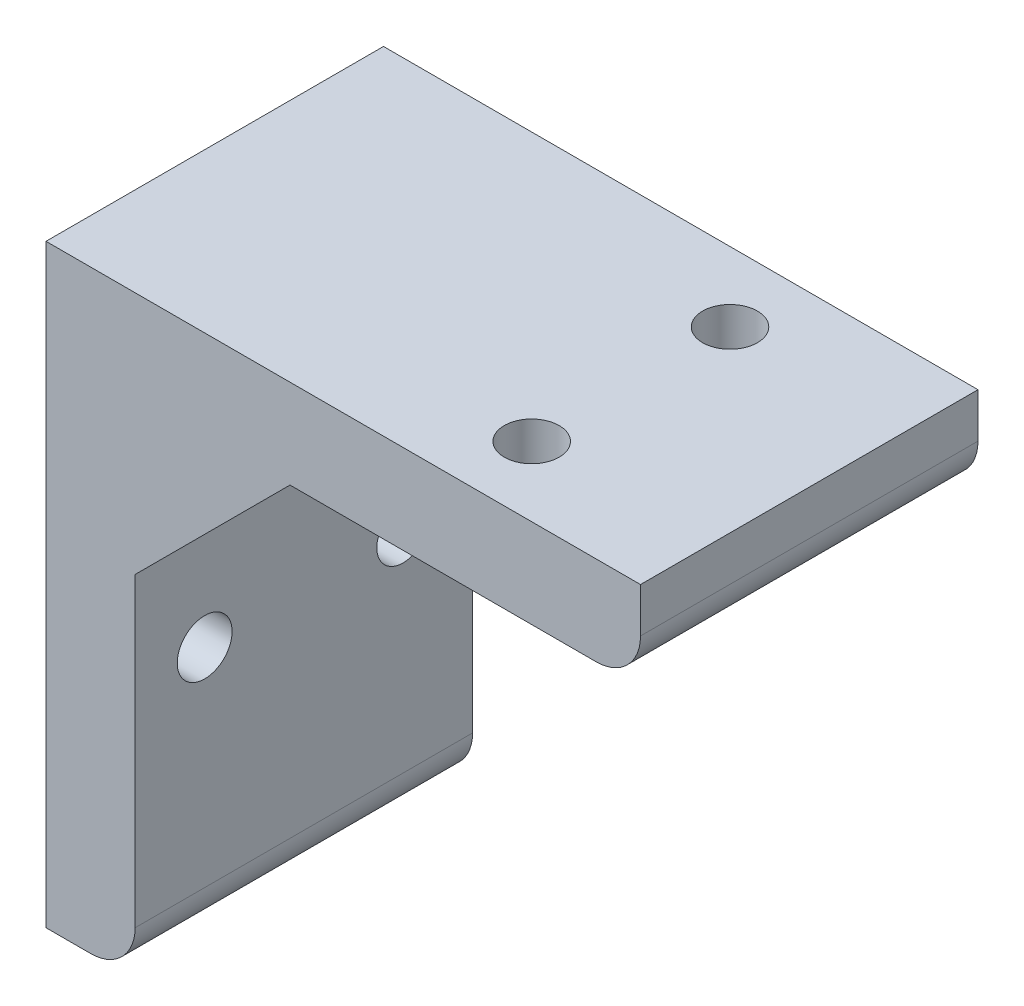
ISO-10303-21;
HEADER;
FILE_DESCRIPTION(('STEP AP214'),'2;1');
FILE_NAME('part.step','',(''),(''),'','','');
FILE_SCHEMA(('AUTOMOTIVE_DESIGN { 1 0 10303 214 1 1 1 1 }'));
ENDSEC;
DATA;
#1=APPLICATION_CONTEXT('core data for automotive mechanical design processes');
#2=APPLICATION_PROTOCOL_DEFINITION('international standard','automotive_design',2000,#1);
#3=PRODUCT_CONTEXT('',#1,'mechanical');
#4=PRODUCT('Part','Part','',(#3));
#5=PRODUCT_RELATED_PRODUCT_CATEGORY('part','',(#4));
#6=PRODUCT_DEFINITION_FORMATION('','',#4);
#7=PRODUCT_DEFINITION_CONTEXT('part definition',#1,'design');
#8=PRODUCT_DEFINITION('design','',#6,#7);
#9=PRODUCT_DEFINITION_SHAPE('','',#8);
#10=(LENGTH_UNIT() NAMED_UNIT(*) SI_UNIT(.MILLI.,.METRE.));
#11=(NAMED_UNIT(*) PLANE_ANGLE_UNIT() SI_UNIT($,.RADIAN.));
#12=(NAMED_UNIT(*) SI_UNIT($,.STERADIAN.) SOLID_ANGLE_UNIT());
#13=UNCERTAINTY_MEASURE_WITH_UNIT(LENGTH_MEASURE(1.E-05),#10,'distance_accuracy_value','');
#14=(GEOMETRIC_REPRESENTATION_CONTEXT(3) GLOBAL_UNCERTAINTY_ASSIGNED_CONTEXT((#13)) GLOBAL_UNIT_ASSIGNED_CONTEXT((#10,
#11,#12)) REPRESENTATION_CONTEXT('',''));
#15=CARTESIAN_POINT('',(0.,0.,0.));
#16=DIRECTION('',(0.,0.,1.));
#17=DIRECTION('',(1.,0.,0.));
#18=AXIS2_PLACEMENT_3D('',#15,#16,#17);
#19=CARTESIAN_POINT('',(8.9916,0.,0.));
#20=DIRECTION('',(-1.,0.,0.));
#21=DIRECTION('',(0.,0.,1.));
#22=AXIS2_PLACEMENT_3D('',#19,#20,#21);
#23=PLANE('',#22);
#24=CARTESIAN_POINT('',(8.9916,-4.49580000000002,-10.0076));
#25=DIRECTION('',(1.,0.,0.));
#26=DIRECTION('',(0.,0.,-1.));
#27=AXIS2_PLACEMENT_3D('',#24,#25,#26);
#28=CIRCLE('',#27,2.6416);
#29=CARTESIAN_POINT('',(8.9916,-4.49580000000002,-12.6492));
#30=VERTEX_POINT('',#29);
#31=EDGE_CURVE('E194',#30,#30,#28,.T.);
#32=ORIENTED_EDGE('',*,*,#31,.F.);
#33=EDGE_LOOP('',(#32));
#34=FACE_BOUND('',#33,.T.);
#35=CARTESIAN_POINT('',(8.9916,-4.49580000000002,10.0076));
#36=DIRECTION('',(1.,0.,0.));
#37=DIRECTION('',(0.,0.,-1.));
#38=AXIS2_PLACEMENT_3D('',#35,#36,#37);
#39=CIRCLE('',#38,2.7686);
#40=CARTESIAN_POINT('',(8.9916,-4.49580000000002,7.23900000000001));
#41=VERTEX_POINT('',#40);
#42=EDGE_CURVE('E188',#41,#41,#39,.T.);
#43=ORIENTED_EDGE('',*,*,#42,.F.);
#44=EDGE_LOOP('',(#43));
#45=FACE_BOUND('',#44,.T.);
#46=DIRECTION('',(0.,-1.,0.));
#47=VECTOR('',#46,1.);
#48=CARTESIAN_POINT('',(8.9916,-30.,17.0307));
#49=LINE('',#48,#47);
#50=CARTESIAN_POINT('',(8.9916,5.3745025901766,17.0307));
#51=VERTEX_POINT('',#50);
#52=CARTESIAN_POINT('',(8.9916,-25.5042,17.0307));
#53=VERTEX_POINT('',#52);
#54=EDGE_CURVE('E117',#51,#53,#49,.T.);
#55=ORIENTED_EDGE('',*,*,#54,.T.);
#56=DIRECTION('',(0.,0.,-1.));
#57=VECTOR('',#56,1.);
#58=CARTESIAN_POINT('',(8.9916,-25.5042,0.));
#59=LINE('',#58,#57);
#60=CARTESIAN_POINT('',(8.9916,-25.5042,-17.0307));
#61=VERTEX_POINT('',#60);
#62=EDGE_CURVE('E160',#53,#61,#59,.T.);
#63=ORIENTED_EDGE('',*,*,#62,.T.);
#64=DIRECTION('',(0.,1.,0.));
#65=VECTOR('',#64,1.);
#66=CARTESIAN_POINT('',(8.9916,-30.,-17.0307));
#67=LINE('',#66,#65);
#68=CARTESIAN_POINT('',(8.9916,5.3745025901766,-17.0307));
#69=VERTEX_POINT('',#68);
#70=EDGE_CURVE('E120',#61,#69,#67,.T.);
#71=ORIENTED_EDGE('',*,*,#70,.T.);
#72=DIRECTION('',(0.,0.,1.));
#73=VECTOR('',#72,1.);
#74=CARTESIAN_POINT('',(8.9916,5.3745025901766,-39.1403697497214));
#75=LINE('',#74,#73);
#76=EDGE_CURVE('E109',#69,#51,#75,.T.);
#77=ORIENTED_EDGE('',*,*,#76,.T.);
#78=EDGE_LOOP('',(#55,#63,#71,#77));
#79=FACE_BOUND('',#78,.T.);
#80=ADVANCED_FACE('F33',(#34,#45,#79),#23,.F.);
#81=CARTESIAN_POINT('',(8.9916,-30.,-17.0307));
#82=DIRECTION('',(0.,0.,1.));
#83=DIRECTION('',(1.,0.,0.));
#84=AXIS2_PLACEMENT_3D('',#81,#82,#83);
#85=PLANE('',#84);
#86=ORIENTED_EDGE('',*,*,#70,.F.);
#87=CARTESIAN_POINT('',(4.4958,-25.5042,-17.0307));
#88=DIRECTION('',(0.,0.,1.));
#89=DIRECTION('',(1.,0.,0.));
#90=AXIS2_PLACEMENT_3D('',#87,#88,#89);
#91=CIRCLE('',#90,4.4958);
#92=CARTESIAN_POINT('',(4.4958,-30.,-17.0307));
#93=VERTEX_POINT('',#92);
#94=EDGE_CURVE('E168',#61,#93,#91,.F.);
#95=ORIENTED_EDGE('',*,*,#94,.T.);
#96=DIRECTION('',(-1.,0.,0.));
#97=VECTOR('',#96,1.);
#98=CARTESIAN_POINT('',(8.9916,-30.,-17.0307));
#99=LINE('',#98,#97);
#100=CARTESIAN_POINT('',(0.,-30.,-17.0307));
#101=VERTEX_POINT('',#100);
#102=EDGE_CURVE('E127',#93,#101,#99,.T.);
#103=ORIENTED_EDGE('',*,*,#102,.T.);
#104=DIRECTION('',(0.,1.,0.));
#105=VECTOR('',#104,1.);
#106=CARTESIAN_POINT('',(0.,-30.,-17.0307));
#107=LINE('',#106,#105);
#108=CARTESIAN_POINT('',(0.,30.,-17.0307));
#109=VERTEX_POINT('',#108);
#110=EDGE_CURVE('E143',#101,#109,#107,.T.);
#111=ORIENTED_EDGE('',*,*,#110,.T.);
#112=DIRECTION('',(-1.,0.,0.));
#113=VECTOR('',#112,1.);
#114=CARTESIAN_POINT('',(8.9916,30.,-17.0307));
#115=LINE('',#114,#113);
#116=CARTESIAN_POINT('',(60.,30.,-17.0307));
#117=VERTEX_POINT('',#116);
#118=EDGE_CURVE('E158',#117,#109,#115,.T.);
#119=ORIENTED_EDGE('',*,*,#118,.F.);
#120=DIRECTION('',(0.,1.,0.));
#121=VECTOR('',#120,1.);
#122=CARTESIAN_POINT('',(60.,30.,-17.0307));
#123=LINE('',#122,#121);
#124=CARTESIAN_POINT('',(60.,25.5042,-17.0307));
#125=VERTEX_POINT('',#124);
#126=EDGE_CURVE('E180',#125,#117,#123,.T.);
#127=ORIENTED_EDGE('',*,*,#126,.F.);
#128=CARTESIAN_POINT('',(55.5042,25.5042,-17.0307));
#129=DIRECTION('',(0.,0.,1.));
#130=DIRECTION('',(1.,0.,0.));
#131=AXIS2_PLACEMENT_3D('',#128,#129,#130);
#132=CIRCLE('',#131,4.4958);
#133=CARTESIAN_POINT('',(55.5042,21.0084,-17.0307));
#134=VERTEX_POINT('',#133);
#135=EDGE_CURVE('E166',#125,#134,#132,.F.);
#136=ORIENTED_EDGE('',*,*,#135,.T.);
#137=DIRECTION('',(-1.,0.,0.));
#138=VECTOR('',#137,1.);
#139=CARTESIAN_POINT('',(60.,21.0084,-17.0307));
#140=LINE('',#139,#138);
#141=CARTESIAN_POINT('',(24.6254974098228,21.0084,-17.0307));
#142=VERTEX_POINT('',#141);
#143=EDGE_CURVE('E163',#134,#142,#140,.T.);
#144=ORIENTED_EDGE('',*,*,#143,.T.);
#145=DIRECTION('',(-0.707106781186534,-0.707106781186561,0.));
#146=VECTOR('',#145,1.);
#147=CARTESIAN_POINT('',(8.9916,5.3745025901766,-17.0307));
#148=LINE('',#147,#146);
#149=EDGE_CURVE('E213',#142,#69,#148,.T.);
#150=ORIENTED_EDGE('',*,*,#149,.T.);
#151=EDGE_LOOP('',(#86,#95,#103,#111,#119,#127,#136,#144,#150));
#152=FACE_BOUND('',#151,.T.);
#153=ADVANCED_FACE('F185',(#152),#85,.F.);
#154=CARTESIAN_POINT('',(8.9916,30.,17.0307));
#155=DIRECTION('',(0.,-1.,0.));
#156=DIRECTION('',(0.,0.,-1.));
#157=AXIS2_PLACEMENT_3D('',#154,#155,#156);
#158=PLANE('',#157);
#159=CARTESIAN_POINT('',(41.995718,30.,10.0076));
#160=DIRECTION('',(0.,1.,0.));
#161=DIRECTION('',(0.,0.,1.));
#162=AXIS2_PLACEMENT_3D('',#159,#160,#161);
#163=CIRCLE('',#162,2.7686);
#164=CARTESIAN_POINT('',(41.995718,30.,12.7762));
#165=VERTEX_POINT('',#164);
#166=EDGE_CURVE('E211',#165,#165,#163,.T.);
#167=ORIENTED_EDGE('',*,*,#166,.F.);
#168=EDGE_LOOP('',(#167));
#169=FACE_BOUND('',#168,.T.);
#170=CARTESIAN_POINT('',(41.995718,30.,-10.0076));
#171=DIRECTION('',(0.,1.,0.));
#172=DIRECTION('',(0.,0.,1.));
#173=AXIS2_PLACEMENT_3D('',#170,#171,#172);
#174=CIRCLE('',#173,2.7686);
#175=CARTESIAN_POINT('',(41.995718,30.,-7.23899999999999));
#176=VERTEX_POINT('',#175);
#177=EDGE_CURVE('E205',#176,#176,#174,.T.);
#178=ORIENTED_EDGE('',*,*,#177,.F.);
#179=EDGE_LOOP('',(#178));
#180=FACE_BOUND('',#179,.T.);
#181=DIRECTION('',(0.,0.,1.));
#182=VECTOR('',#181,1.);
#183=CARTESIAN_POINT('',(0.,30.,17.0307));
#184=LINE('',#183,#182);
#185=CARTESIAN_POINT('',(0.,30.,17.0307));
#186=VERTEX_POINT('',#185);
#187=EDGE_CURVE('E146',#109,#186,#184,.T.);
#188=ORIENTED_EDGE('',*,*,#187,.T.);
#189=DIRECTION('',(-1.,0.,0.));
#190=VECTOR('',#189,1.);
#191=CARTESIAN_POINT('',(8.9916,30.,17.0307));
#192=LINE('',#191,#190);
#193=CARTESIAN_POINT('',(60.,30.,17.0307));
#194=VERTEX_POINT('',#193);
#195=EDGE_CURVE('E155',#194,#186,#192,.T.);
#196=ORIENTED_EDGE('',*,*,#195,.F.);
#197=DIRECTION('',(0.,0.,1.));
#198=VECTOR('',#197,1.);
#199=CARTESIAN_POINT('',(60.,30.,17.0307));
#200=LINE('',#199,#198);
#201=EDGE_CURVE('E165',#117,#194,#200,.T.);
#202=ORIENTED_EDGE('',*,*,#201,.F.);
#203=ORIENTED_EDGE('',*,*,#118,.T.);
#204=EDGE_LOOP('',(#188,#196,#202,#203));
#205=FACE_BOUND('',#204,.T.);
#206=ADVANCED_FACE('F230',(#169,#180,#205),#158,.F.);
#207=CARTESIAN_POINT('',(8.9916,-30.,17.0307));
#208=DIRECTION('',(0.,0.,-1.));
#209=DIRECTION('',(-1.,0.,0.));
#210=AXIS2_PLACEMENT_3D('',#207,#208,#209);
#211=PLANE('',#210);
#212=DIRECTION('',(-1.,0.,0.));
#213=VECTOR('',#212,1.);
#214=CARTESIAN_POINT('',(8.9916,-30.,17.0307));
#215=LINE('',#214,#213);
#216=CARTESIAN_POINT('',(4.4958,-30.,17.0307));
#217=VERTEX_POINT('',#216);
#218=CARTESIAN_POINT('',(0.,-30.,17.0307));
#219=VERTEX_POINT('',#218);
#220=EDGE_CURVE('E129',#217,#219,#215,.T.);
#221=ORIENTED_EDGE('',*,*,#220,.F.);
#222=CARTESIAN_POINT('',(4.4958,-25.5042,17.0307));
#223=DIRECTION('',(0.,0.,-1.));
#224=DIRECTION('',(-1.,0.,0.));
#225=AXIS2_PLACEMENT_3D('',#222,#223,#224);
#226=CIRCLE('',#225,4.4958);
#227=EDGE_CURVE('E126',#217,#53,#226,.F.);
#228=ORIENTED_EDGE('',*,*,#227,.T.);
#229=ORIENTED_EDGE('',*,*,#54,.F.);
#230=DIRECTION('',(0.707106781186534,0.707106781186561,0.));
#231=VECTOR('',#230,1.);
#232=CARTESIAN_POINT('',(8.9916,5.3745025901766,17.0307));
#233=LINE('',#232,#231);
#234=CARTESIAN_POINT('',(24.6254974098228,21.0084,17.0307));
#235=VERTEX_POINT('',#234);
#236=EDGE_CURVE('E105',#51,#235,#233,.T.);
#237=ORIENTED_EDGE('',*,*,#236,.T.);
#238=DIRECTION('',(-1.,0.,0.));
#239=VECTOR('',#238,1.);
#240=CARTESIAN_POINT('',(60.,21.0084,17.0307));
#241=LINE('',#240,#239);
#242=CARTESIAN_POINT('',(55.5042,21.0084,17.0307));
#243=VERTEX_POINT('',#242);
#244=EDGE_CURVE('E147',#243,#235,#241,.T.);
#245=ORIENTED_EDGE('',*,*,#244,.F.);
#246=CARTESIAN_POINT('',(55.5042,25.5042,17.0307));
#247=DIRECTION('',(0.,0.,-1.));
#248=DIRECTION('',(-1.,0.,0.));
#249=AXIS2_PLACEMENT_3D('',#246,#247,#248);
#250=CIRCLE('',#249,4.4958);
#251=CARTESIAN_POINT('',(60.,25.5042,17.0307));
#252=VERTEX_POINT('',#251);
#253=EDGE_CURVE('E48',#243,#252,#250,.F.);
#254=ORIENTED_EDGE('',*,*,#253,.T.);
#255=DIRECTION('',(0.,-1.,0.));
#256=VECTOR('',#255,1.);
#257=CARTESIAN_POINT('',(60.,30.,17.0307));
#258=LINE('',#257,#256);
#259=EDGE_CURVE('E182',#194,#252,#258,.T.);
#260=ORIENTED_EDGE('',*,*,#259,.F.);
#261=ORIENTED_EDGE('',*,*,#195,.T.);
#262=DIRECTION('',(0.,-1.,0.));
#263=VECTOR('',#262,1.);
#264=CARTESIAN_POINT('',(0.,-30.,17.0307));
#265=LINE('',#264,#263);
#266=EDGE_CURVE('E149',#186,#219,#265,.T.);
#267=ORIENTED_EDGE('',*,*,#266,.T.);
#268=EDGE_LOOP('',(#221,#228,#229,#237,#245,#254,#260,#261,#267));
#269=FACE_BOUND('',#268,.T.);
#270=ADVANCED_FACE('F124',(#269),#211,.F.);
#271=CARTESIAN_POINT('',(8.9916,-30.,17.0307));
#272=DIRECTION('',(0.,1.,0.));
#273=DIRECTION('',(0.,0.,1.));
#274=AXIS2_PLACEMENT_3D('',#271,#272,#273);
#275=PLANE('',#274);
#276=ORIENTED_EDGE('',*,*,#102,.F.);
#277=DIRECTION('',(0.,0.,-1.));
#278=VECTOR('',#277,1.);
#279=CARTESIAN_POINT('',(4.4958,-30.,17.0307));
#280=LINE('',#279,#278);
#281=EDGE_CURVE('E170',#93,#217,#280,.F.);
#282=ORIENTED_EDGE('',*,*,#281,.T.);
#283=ORIENTED_EDGE('',*,*,#220,.T.);
#284=DIRECTION('',(0.,0.,-1.));
#285=VECTOR('',#284,1.);
#286=CARTESIAN_POINT('',(0.,-30.,17.0307));
#287=LINE('',#286,#285);
#288=EDGE_CURVE('E131',#219,#101,#287,.T.);
#289=ORIENTED_EDGE('',*,*,#288,.T.);
#290=EDGE_LOOP('',(#276,#282,#283,#289));
#291=FACE_BOUND('',#290,.T.);
#292=ADVANCED_FACE('F240',(#291),#275,.F.);
#293=CARTESIAN_POINT('',(0.,0.,0.));
#294=DIRECTION('',(-1.,0.,0.));
#295=DIRECTION('',(0.,0.,1.));
#296=AXIS2_PLACEMENT_3D('',#293,#294,#295);
#297=PLANE('',#296);
#298=CARTESIAN_POINT('',(0.,-4.49580000000002,-10.0076));
#299=DIRECTION('',(-1.,0.,0.));
#300=DIRECTION('',(0.,0.,1.));
#301=AXIS2_PLACEMENT_3D('',#298,#299,#300);
#302=CIRCLE('',#301,2.6416);
#303=CARTESIAN_POINT('',(0.,-4.49580000000002,-7.36599999999999));
#304=VERTEX_POINT('',#303);
#305=EDGE_CURVE('E197',#304,#304,#302,.F.);
#306=ORIENTED_EDGE('',*,*,#305,.T.);
#307=EDGE_LOOP('',(#306));
#308=FACE_BOUND('',#307,.T.);
#309=CARTESIAN_POINT('',(0.,-4.49580000000002,10.0076));
#310=DIRECTION('',(-1.,0.,0.));
#311=DIRECTION('',(0.,0.,1.));
#312=AXIS2_PLACEMENT_3D('',#309,#310,#311);
#313=CIRCLE('',#312,2.7686);
#314=CARTESIAN_POINT('',(0.,-4.49580000000002,12.7762));
#315=VERTEX_POINT('',#314);
#316=EDGE_CURVE('E191',#315,#315,#313,.F.);
#317=ORIENTED_EDGE('',*,*,#316,.T.);
#318=EDGE_LOOP('',(#317));
#319=FACE_BOUND('',#318,.T.);
#320=ORIENTED_EDGE('',*,*,#110,.F.);
#321=ORIENTED_EDGE('',*,*,#288,.F.);
#322=ORIENTED_EDGE('',*,*,#266,.F.);
#323=ORIENTED_EDGE('',*,*,#187,.F.);
#324=EDGE_LOOP('',(#320,#321,#322,#323));
#325=FACE_BOUND('',#324,.T.);
#326=ADVANCED_FACE('F237',(#308,#319,#325),#297,.T.);
#327=CARTESIAN_POINT('',(60.,21.0084,17.0307));
#328=DIRECTION('',(0.,1.,0.));
#329=DIRECTION('',(0.,0.,1.));
#330=AXIS2_PLACEMENT_3D('',#327,#328,#329);
#331=PLANE('',#330);
#332=CARTESIAN_POINT('',(41.995718,21.0084,10.0076));
#333=DIRECTION('',(0.,1.,0.));
#334=DIRECTION('',(0.,0.,1.));
#335=AXIS2_PLACEMENT_3D('',#332,#333,#334);
#336=CIRCLE('',#335,2.7686);
#337=CARTESIAN_POINT('',(41.995718,21.0084,12.7762));
#338=VERTEX_POINT('',#337);
#339=EDGE_CURVE('E208',#338,#338,#336,.F.);
#340=ORIENTED_EDGE('',*,*,#339,.F.);
#341=EDGE_LOOP('',(#340));
#342=FACE_BOUND('',#341,.T.);
#343=CARTESIAN_POINT('',(41.995718,21.0084,-10.0076));
#344=DIRECTION('',(0.,1.,0.));
#345=DIRECTION('',(0.,0.,1.));
#346=AXIS2_PLACEMENT_3D('',#343,#344,#345);
#347=CIRCLE('',#346,2.7686);
#348=CARTESIAN_POINT('',(41.995718,21.0084,-7.23899999999999));
#349=VERTEX_POINT('',#348);
#350=EDGE_CURVE('E200',#349,#349,#347,.F.);
#351=ORIENTED_EDGE('',*,*,#350,.F.);
#352=EDGE_LOOP('',(#351));
#353=FACE_BOUND('',#352,.T.);
#354=ORIENTED_EDGE('',*,*,#143,.F.);
#355=DIRECTION('',(0.,0.,-1.));
#356=VECTOR('',#355,1.);
#357=CARTESIAN_POINT('',(55.5042,21.0084,17.0307));
#358=LINE('',#357,#356);
#359=EDGE_CURVE('E11',#134,#243,#358,.F.);
#360=ORIENTED_EDGE('',*,*,#359,.T.);
#361=ORIENTED_EDGE('',*,*,#244,.T.);
#362=DIRECTION('',(0.,0.,1.));
#363=VECTOR('',#362,1.);
#364=CARTESIAN_POINT('',(24.6254974098228,21.0084,-39.1403697497214));
#365=LINE('',#364,#363);
#366=EDGE_CURVE('E111',#142,#235,#365,.T.);
#367=ORIENTED_EDGE('',*,*,#366,.F.);
#368=EDGE_LOOP('',(#354,#360,#361,#367));
#369=FACE_BOUND('',#368,.T.);
#370=ADVANCED_FACE('F216',(#342,#353,#369),#331,.F.);
#371=CARTESIAN_POINT('',(60.,0.,0.));
#372=DIRECTION('',(1.,0.,0.));
#373=DIRECTION('',(0.,0.,-1.));
#374=AXIS2_PLACEMENT_3D('',#371,#372,#373);
#375=PLANE('',#374);
#376=ORIENTED_EDGE('',*,*,#259,.T.);
#377=DIRECTION('',(0.,0.,-1.));
#378=VECTOR('',#377,1.);
#379=CARTESIAN_POINT('',(60.,25.5042,-17.0307));
#380=LINE('',#379,#378);
#381=EDGE_CURVE('E41',#252,#125,#380,.T.);
#382=ORIENTED_EDGE('',*,*,#381,.T.);
#383=ORIENTED_EDGE('',*,*,#126,.T.);
#384=ORIENTED_EDGE('',*,*,#201,.T.);
#385=EDGE_LOOP('',(#376,#382,#383,#384));
#386=FACE_BOUND('',#385,.T.);
#387=ADVANCED_FACE('F178',(#386),#375,.T.);
#388=CARTESIAN_POINT('',(-0.000999999999999265,-4.49580000000002,10.0076));
#389=DIRECTION('',(1.,0.,0.));
#390=DIRECTION('',(0.,0.,-1.));
#391=AXIS2_PLACEMENT_3D('',#388,#389,#390);
#392=CYLINDRICAL_SURFACE('',#391,2.7686);
#393=ORIENTED_EDGE('',*,*,#316,.F.);
#394=EDGE_LOOP('',(#393));
#395=FACE_BOUND('',#394,.T.);
#396=ORIENTED_EDGE('',*,*,#42,.T.);
#397=EDGE_LOOP('',(#396));
#398=FACE_BOUND('',#397,.T.);
#399=ADVANCED_FACE('F277',(#395,#398),#392,.F.);
#400=CARTESIAN_POINT('',(-0.000999999999999265,-4.49580000000002,-10.0076));
#401=DIRECTION('',(1.,0.,0.));
#402=DIRECTION('',(0.,0.,-1.));
#403=AXIS2_PLACEMENT_3D('',#400,#401,#402);
#404=CYLINDRICAL_SURFACE('',#403,2.6416);
#405=ORIENTED_EDGE('',*,*,#305,.F.);
#406=EDGE_LOOP('',(#405));
#407=FACE_BOUND('',#406,.T.);
#408=ORIENTED_EDGE('',*,*,#31,.T.);
#409=EDGE_LOOP('',(#408));
#410=FACE_BOUND('',#409,.T.);
#411=ADVANCED_FACE('F268',(#407,#410),#404,.F.);
#412=CARTESIAN_POINT('',(41.995718,-30.001025,-10.0076));
#413=DIRECTION('',(0.,1.,0.));
#414=DIRECTION('',(0.,0.,1.));
#415=AXIS2_PLACEMENT_3D('',#412,#413,#414);
#416=CYLINDRICAL_SURFACE('',#415,2.7686);
#417=ORIENTED_EDGE('',*,*,#177,.T.);
#418=EDGE_LOOP('',(#417));
#419=FACE_BOUND('',#418,.T.);
#420=ORIENTED_EDGE('',*,*,#350,.T.);
#421=EDGE_LOOP('',(#420));
#422=FACE_BOUND('',#421,.T.);
#423=ADVANCED_FACE('F264',(#419,#422),#416,.F.);
#424=CARTESIAN_POINT('',(41.995718,-30.001025,10.0076));
#425=DIRECTION('',(0.,1.,0.));
#426=DIRECTION('',(0.,0.,1.));
#427=AXIS2_PLACEMENT_3D('',#424,#425,#426);
#428=CYLINDRICAL_SURFACE('',#427,2.7686);
#429=ORIENTED_EDGE('',*,*,#166,.T.);
#430=EDGE_LOOP('',(#429));
#431=FACE_BOUND('',#430,.T.);
#432=ORIENTED_EDGE('',*,*,#339,.T.);
#433=EDGE_LOOP('',(#432));
#434=FACE_BOUND('',#433,.T.);
#435=ADVANCED_FACE('F267',(#431,#434),#428,.F.);
#436=CARTESIAN_POINT('',(8.9916,5.3745025901766,-39.1403697497214));
#437=DIRECTION('',(0.707106781186561,-0.707106781186534,0.));
#438=DIRECTION('',(0.707106781186534,0.707106781186561,0.));
#439=AXIS2_PLACEMENT_3D('',#436,#437,#438);
#440=PLANE('',#439);
#441=ORIENTED_EDGE('',*,*,#149,.F.);
#442=ORIENTED_EDGE('',*,*,#366,.T.);
#443=ORIENTED_EDGE('',*,*,#236,.F.);
#444=ORIENTED_EDGE('',*,*,#76,.F.);
#445=EDGE_LOOP('',(#441,#442,#443,#444));
#446=FACE_BOUND('',#445,.T.);
#447=ADVANCED_FACE('F108',(#446),#440,.T.);
#448=CARTESIAN_POINT('',(4.4958,-25.5042,0.));
#449=DIRECTION('',(0.,0.,-1.));
#450=DIRECTION('',(-1.,0.,0.));
#451=AXIS2_PLACEMENT_3D('',#448,#449,#450);
#452=CYLINDRICAL_SURFACE('',#451,4.4958);
#453=ORIENTED_EDGE('',*,*,#227,.F.);
#454=ORIENTED_EDGE('',*,*,#281,.F.);
#455=ORIENTED_EDGE('',*,*,#94,.F.);
#456=ORIENTED_EDGE('',*,*,#62,.F.);
#457=EDGE_LOOP('',(#453,#454,#455,#456));
#458=FACE_BOUND('',#457,.T.);
#459=ADVANCED_FACE('F218',(#458),#452,.T.);
#460=CARTESIAN_POINT('',(55.5042,25.5042,0.));
#461=DIRECTION('',(0.,0.,1.));
#462=DIRECTION('',(0.,-1.,0.));
#463=AXIS2_PLACEMENT_3D('',#460,#461,#462);
#464=CYLINDRICAL_SURFACE('',#463,4.4958);
#465=ORIENTED_EDGE('',*,*,#253,.F.);
#466=ORIENTED_EDGE('',*,*,#359,.F.);
#467=ORIENTED_EDGE('',*,*,#135,.F.);
#468=ORIENTED_EDGE('',*,*,#381,.F.);
#469=EDGE_LOOP('',(#465,#466,#467,#468));
#470=FACE_BOUND('',#469,.T.);
#471=ADVANCED_FACE('F35',(#470),#464,.T.);
#472=CLOSED_SHELL('',(#80,#153,#206,#270,#292,#326,#370,#387,#399,#411,#423,#435,#447,#459,#471));
#473=MANIFOLD_SOLID_BREP('B2',#472);
#474=ADVANCED_BREP_SHAPE_REPRESENTATION('',(#18,#473),#14);
#475=SHAPE_DEFINITION_REPRESENTATION(#9,#474);
ENDSEC;
END-ISO-10303-21;
